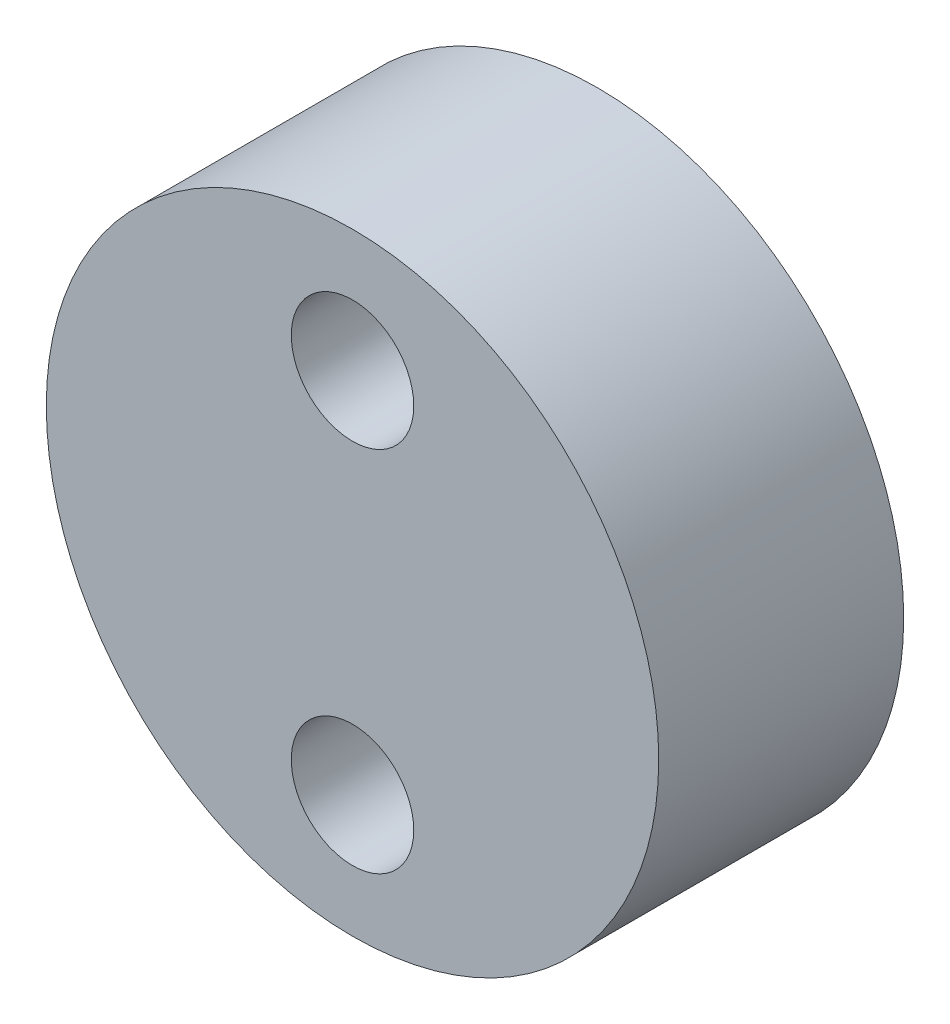
ISO-10303-21;
HEADER;
FILE_DESCRIPTION(('STEP AP214'),'2;1');
FILE_NAME('part.step','',(''),(''),'','','');
FILE_SCHEMA(('AUTOMOTIVE_DESIGN { 1 0 10303 214 1 1 1 1 }'));
ENDSEC;
DATA;
#1=APPLICATION_CONTEXT('core data for automotive mechanical design processes');
#2=APPLICATION_PROTOCOL_DEFINITION('international standard','automotive_design',2000,#1);
#3=PRODUCT_CONTEXT('',#1,'mechanical');
#4=PRODUCT('Part','Part','',(#3));
#5=PRODUCT_RELATED_PRODUCT_CATEGORY('part','',(#4));
#6=PRODUCT_DEFINITION_FORMATION('','',#4);
#7=PRODUCT_DEFINITION_CONTEXT('part definition',#1,'design');
#8=PRODUCT_DEFINITION('design','',#6,#7);
#9=PRODUCT_DEFINITION_SHAPE('','',#8);
#10=(LENGTH_UNIT() NAMED_UNIT(*) SI_UNIT(.MILLI.,.METRE.));
#11=(NAMED_UNIT(*) PLANE_ANGLE_UNIT() SI_UNIT($,.RADIAN.));
#12=(NAMED_UNIT(*) SI_UNIT($,.STERADIAN.) SOLID_ANGLE_UNIT());
#13=UNCERTAINTY_MEASURE_WITH_UNIT(LENGTH_MEASURE(1.E-05),#10,'distance_accuracy_value','');
#14=(GEOMETRIC_REPRESENTATION_CONTEXT(3) GLOBAL_UNCERTAINTY_ASSIGNED_CONTEXT((#13)) GLOBAL_UNIT_ASSIGNED_CONTEXT((#10,
#11,#12)) REPRESENTATION_CONTEXT('',''));
#15=CARTESIAN_POINT('',(0.,0.,0.));
#16=DIRECTION('',(0.,0.,1.));
#17=DIRECTION('',(1.,0.,0.));
#18=AXIS2_PLACEMENT_3D('',#15,#16,#17);
#19=CARTESIAN_POINT('',(0.,0.,20.));
#20=DIRECTION('',(0.,0.,1.));
#21=DIRECTION('',(1.,0.,0.));
#22=AXIS2_PLACEMENT_3D('',#19,#20,#21);
#23=PLANE('',#22);
#24=CARTESIAN_POINT('',(0.,15.,20.));
#25=DIRECTION('',(0.,0.,1.));
#26=DIRECTION('',(1.,0.,0.));
#27=AXIS2_PLACEMENT_3D('',#24,#25,#26);
#28=CIRCLE('',#27,5.);
#29=CARTESIAN_POINT('',(5.,15.,20.));
#30=VERTEX_POINT('',#29);
#31=EDGE_CURVE('E42',#30,#30,#28,.T.);
#32=ORIENTED_EDGE('',*,*,#31,.F.);
#33=EDGE_LOOP('',(#32));
#34=FACE_BOUND('',#33,.T.);
#35=CARTESIAN_POINT('',(0.,0.,20.));
#36=DIRECTION('',(0.,0.,1.));
#37=DIRECTION('',(1.,0.,0.));
#38=AXIS2_PLACEMENT_3D('',#35,#36,#37);
#39=CIRCLE('',#38,25.);
#40=CARTESIAN_POINT('',(25.,0.,20.));
#41=VERTEX_POINT('',#40);
#42=EDGE_CURVE('E10',#41,#41,#39,.T.);
#43=ORIENTED_EDGE('',*,*,#42,.T.);
#44=EDGE_LOOP('',(#43));
#45=FACE_BOUND('',#44,.T.);
#46=CARTESIAN_POINT('',(0.,-15.,20.));
#47=DIRECTION('',(0.,0.,1.));
#48=DIRECTION('',(1.,0.,0.));
#49=AXIS2_PLACEMENT_3D('',#46,#47,#48);
#50=CIRCLE('',#49,5.);
#51=CARTESIAN_POINT('',(5.,-15.,20.));
#52=VERTEX_POINT('',#51);
#53=EDGE_CURVE('E47',#52,#52,#50,.T.);
#54=ORIENTED_EDGE('',*,*,#53,.F.);
#55=EDGE_LOOP('',(#54));
#56=FACE_BOUND('',#55,.T.);
#57=ADVANCED_FACE('F31',(#34,#45,#56),#23,.T.);
#58=CARTESIAN_POINT('',(0.,0.,0.));
#59=DIRECTION('',(0.,0.,1.));
#60=DIRECTION('',(1.,0.,0.));
#61=AXIS2_PLACEMENT_3D('',#58,#59,#60);
#62=PLANE('',#61);
#63=CARTESIAN_POINT('',(0.,0.,0.));
#64=DIRECTION('',(0.,0.,1.));
#65=DIRECTION('',(1.,0.,0.));
#66=AXIS2_PLACEMENT_3D('',#63,#64,#65);
#67=CIRCLE('',#66,25.);
#68=CARTESIAN_POINT('',(25.,0.,0.));
#69=VERTEX_POINT('',#68);
#70=EDGE_CURVE('E35',#69,#69,#67,.T.);
#71=ORIENTED_EDGE('',*,*,#70,.F.);
#72=EDGE_LOOP('',(#71));
#73=FACE_BOUND('',#72,.T.);
#74=CARTESIAN_POINT('',(0.,15.,0.));
#75=DIRECTION('',(0.,0.,1.));
#76=DIRECTION('',(1.,0.,0.));
#77=AXIS2_PLACEMENT_3D('',#74,#75,#76);
#78=CIRCLE('',#77,5.);
#79=CARTESIAN_POINT('',(5.,15.,0.));
#80=VERTEX_POINT('',#79);
#81=EDGE_CURVE('E44',#80,#80,#78,.T.);
#82=ORIENTED_EDGE('',*,*,#81,.T.);
#83=EDGE_LOOP('',(#82));
#84=FACE_BOUND('',#83,.T.);
#85=CARTESIAN_POINT('',(0.,-15.,0.));
#86=DIRECTION('',(0.,0.,1.));
#87=DIRECTION('',(1.,0.,0.));
#88=AXIS2_PLACEMENT_3D('',#85,#86,#87);
#89=CIRCLE('',#88,5.);
#90=CARTESIAN_POINT('',(5.,-15.,0.));
#91=VERTEX_POINT('',#90);
#92=EDGE_CURVE('E50',#91,#91,#89,.T.);
#93=ORIENTED_EDGE('',*,*,#92,.T.);
#94=EDGE_LOOP('',(#93));
#95=FACE_BOUND('',#94,.T.);
#96=ADVANCED_FACE('F60',(#73,#84,#95),#62,.F.);
#97=CARTESIAN_POINT('',(0.,0.,20.));
#98=DIRECTION('',(0.,0.,-1.));
#99=DIRECTION('',(-1.,0.,0.));
#100=AXIS2_PLACEMENT_3D('',#97,#98,#99);
#101=CYLINDRICAL_SURFACE('',#100,25.);
#102=ORIENTED_EDGE('',*,*,#42,.F.);
#103=EDGE_LOOP('',(#102));
#104=FACE_BOUND('',#103,.T.);
#105=ORIENTED_EDGE('',*,*,#70,.T.);
#106=EDGE_LOOP('',(#105));
#107=FACE_BOUND('',#106,.T.);
#108=ADVANCED_FACE('F33',(#104,#107),#101,.T.);
#109=CARTESIAN_POINT('',(0.,15.,20.));
#110=DIRECTION('',(0.,0.,-1.));
#111=DIRECTION('',(-1.,0.,0.));
#112=AXIS2_PLACEMENT_3D('',#109,#110,#111);
#113=CYLINDRICAL_SURFACE('',#112,5.);
#114=ORIENTED_EDGE('',*,*,#31,.T.);
#115=EDGE_LOOP('',(#114));
#116=FACE_BOUND('',#115,.T.);
#117=ORIENTED_EDGE('',*,*,#81,.F.);
#118=EDGE_LOOP('',(#117));
#119=FACE_BOUND('',#118,.T.);
#120=ADVANCED_FACE('F69',(#116,#119),#113,.F.);
#121=CARTESIAN_POINT('',(0.,-15.,20.));
#122=DIRECTION('',(0.,0.,-1.));
#123=DIRECTION('',(-1.,0.,0.));
#124=AXIS2_PLACEMENT_3D('',#121,#122,#123);
#125=CYLINDRICAL_SURFACE('',#124,5.);
#126=ORIENTED_EDGE('',*,*,#53,.T.);
#127=EDGE_LOOP('',(#126));
#128=FACE_BOUND('',#127,.T.);
#129=ORIENTED_EDGE('',*,*,#92,.F.);
#130=EDGE_LOOP('',(#129));
#131=FACE_BOUND('',#130,.T.);
#132=ADVANCED_FACE('F56',(#128,#131),#125,.F.);
#133=CLOSED_SHELL('',(#57,#96,#108,#120,#132));
#134=MANIFOLD_SOLID_BREP('B2',#133);
#135=ADVANCED_BREP_SHAPE_REPRESENTATION('',(#18,#134),#14);
#136=SHAPE_DEFINITION_REPRESENTATION(#9,#135);
ENDSEC;
END-ISO-10303-21;
